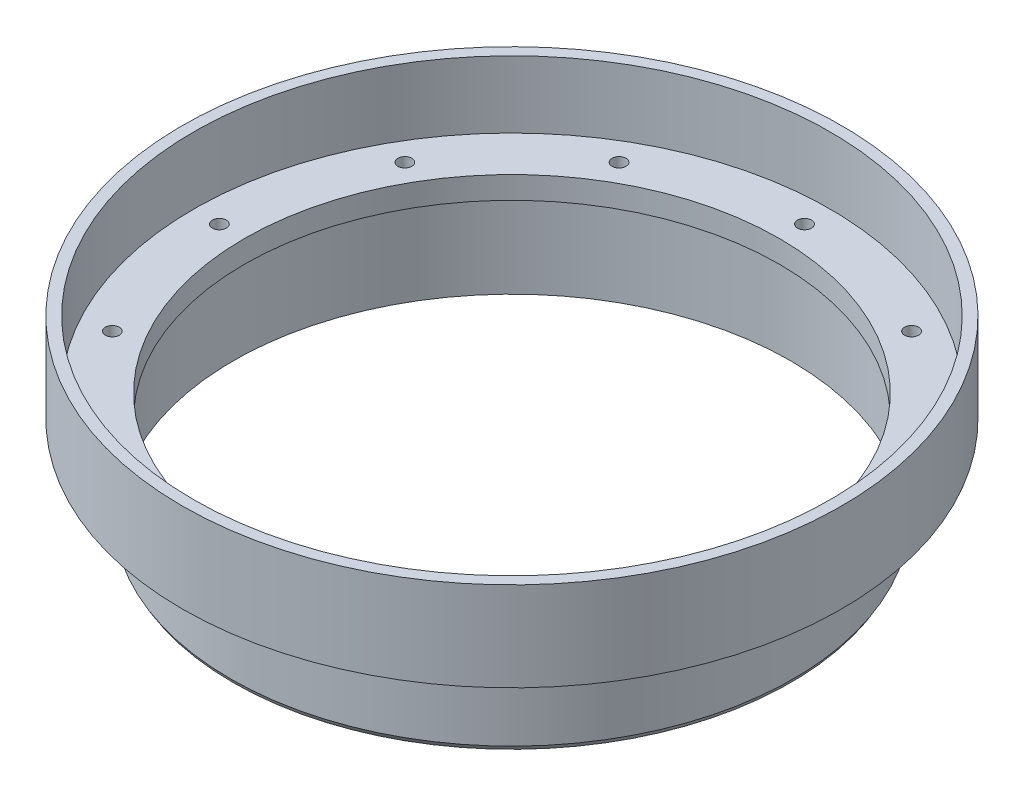
ISO-10303-21;
HEADER;
FILE_DESCRIPTION(('STEP AP214'),'2;1');
FILE_NAME('part.step','',(''),(''),'','','');
FILE_SCHEMA(('AUTOMOTIVE_DESIGN { 1 0 10303 214 1 1 1 1 }'));
ENDSEC;
DATA;
#1=APPLICATION_CONTEXT('core data for automotive mechanical design processes');
#2=APPLICATION_PROTOCOL_DEFINITION('international standard','automotive_design',2000,#1);
#3=PRODUCT_CONTEXT('',#1,'mechanical');
#4=PRODUCT('Part','Part','',(#3));
#5=PRODUCT_RELATED_PRODUCT_CATEGORY('part','',(#4));
#6=PRODUCT_DEFINITION_FORMATION('','',#4);
#7=PRODUCT_DEFINITION_CONTEXT('part definition',#1,'design');
#8=PRODUCT_DEFINITION('design','',#6,#7);
#9=PRODUCT_DEFINITION_SHAPE('','',#8);
#10=(LENGTH_UNIT() NAMED_UNIT(*) SI_UNIT(.MILLI.,.METRE.));
#11=(NAMED_UNIT(*) PLANE_ANGLE_UNIT() SI_UNIT($,.RADIAN.));
#12=(NAMED_UNIT(*) SI_UNIT($,.STERADIAN.) SOLID_ANGLE_UNIT());
#13=UNCERTAINTY_MEASURE_WITH_UNIT(LENGTH_MEASURE(1.E-05),#10,'distance_accuracy_value','');
#14=(GEOMETRIC_REPRESENTATION_CONTEXT(3) GLOBAL_UNCERTAINTY_ASSIGNED_CONTEXT((#13)) GLOBAL_UNIT_ASSIGNED_CONTEXT((#10,
#11,#12)) REPRESENTATION_CONTEXT('',''));
#15=CARTESIAN_POINT('',(0.,0.,0.));
#16=DIRECTION('',(0.,0.,1.));
#17=DIRECTION('',(1.,0.,0.));
#18=AXIS2_PLACEMENT_3D('',#15,#16,#17);
#19=CARTESIAN_POINT('',(-45.339,0.,0.));
#20=DIRECTION('',(0.,1.,0.));
#21=DIRECTION('',(0.,0.,1.));
#22=AXIS2_PLACEMENT_3D('',#19,#20,#21);
#23=PLANE('',#22);
#24=CARTESIAN_POINT('',(-36.0751542200448,0.,20.8279999999996));
#25=DIRECTION('',(0.,1.,0.));
#26=DIRECTION('',(0.,0.,1.));
#27=AXIS2_PLACEMENT_3D('',#24,#25,#26);
#28=CIRCLE('',#27,0.996949999999996);
#29=CARTESIAN_POINT('',(-36.0751542200448,0.,21.8249499999996));
#30=VERTEX_POINT('',#29);
#31=EDGE_CURVE('E154',#30,#30,#28,.T.);
#32=ORIENTED_EDGE('',*,*,#31,.F.);
#33=EDGE_LOOP('',(#32));
#34=FACE_BOUND('',#33,.T.);
#35=CARTESIAN_POINT('',(-20.8280000000004,0.,36.0751542200444));
#36=DIRECTION('',(0.,1.,0.));
#37=DIRECTION('',(0.,0.,1.));
#38=AXIS2_PLACEMENT_3D('',#35,#36,#37);
#39=CIRCLE('',#38,0.99695);
#40=CARTESIAN_POINT('',(-20.8280000000004,0.,37.0721042200444));
#41=VERTEX_POINT('',#40);
#42=EDGE_CURVE('E158',#41,#41,#39,.T.);
#43=ORIENTED_EDGE('',*,*,#42,.F.);
#44=EDGE_LOOP('',(#43));
#45=FACE_BOUND('',#44,.T.);
#46=CARTESIAN_POINT('',(-3.57226130743964E-13,0.,41.656));
#47=DIRECTION('',(0.,1.,0.));
#48=DIRECTION('',(0.,0.,1.));
#49=AXIS2_PLACEMENT_3D('',#46,#47,#48);
#50=CIRCLE('',#49,0.996949999999999);
#51=CARTESIAN_POINT('',(-3.57226130743964E-13,0.,42.65295));
#52=VERTEX_POINT('',#51);
#53=EDGE_CURVE('E86',#52,#52,#50,.T.);
#54=ORIENTED_EDGE('',*,*,#53,.F.);
#55=EDGE_LOOP('',(#54));
#56=FACE_BOUND('',#55,.T.);
#57=CARTESIAN_POINT('',(20.8279999999997,0.,36.0751542200447));
#58=DIRECTION('',(0.,1.,0.));
#59=DIRECTION('',(0.,0.,1.));
#60=AXIS2_PLACEMENT_3D('',#57,#58,#59);
#61=CIRCLE('',#60,0.99695);
#62=CARTESIAN_POINT('',(20.8279999999997,0.,37.0721042200447));
#63=VERTEX_POINT('',#62);
#64=EDGE_CURVE('E75',#63,#63,#61,.T.);
#65=ORIENTED_EDGE('',*,*,#64,.F.);
#66=EDGE_LOOP('',(#65));
#67=FACE_BOUND('',#66,.T.);
#68=CARTESIAN_POINT('',(36.0751542200444,0.,20.8280000000002));
#69=DIRECTION('',(0.,1.,0.));
#70=DIRECTION('',(0.,0.,1.));
#71=AXIS2_PLACEMENT_3D('',#68,#69,#70);
#72=CIRCLE('',#71,0.996949999999996);
#73=CARTESIAN_POINT('',(36.0751542200444,0.,21.8249500000002));
#74=VERTEX_POINT('',#73);
#75=EDGE_CURVE('E72',#74,#74,#72,.T.);
#76=ORIENTED_EDGE('',*,*,#75,.F.);
#77=EDGE_LOOP('',(#76));
#78=FACE_BOUND('',#77,.T.);
#79=CARTESIAN_POINT('',(41.656,0.,2.30283964218628E-13));
#80=DIRECTION('',(0.,1.,0.));
#81=DIRECTION('',(0.,0.,1.));
#82=AXIS2_PLACEMENT_3D('',#79,#80,#81);
#83=CIRCLE('',#82,0.996949999999996);
#84=CARTESIAN_POINT('',(41.656,0.,0.996950000000227));
#85=VERTEX_POINT('',#84);
#86=EDGE_CURVE('E71',#85,#85,#83,.T.);
#87=ORIENTED_EDGE('',*,*,#86,.F.);
#88=EDGE_LOOP('',(#87));
#89=FACE_BOUND('',#88,.T.);
#90=CARTESIAN_POINT('',(36.0751542200447,0.,-20.8279999999998));
#91=DIRECTION('',(0.,1.,0.));
#92=DIRECTION('',(0.,0.,1.));
#93=AXIS2_PLACEMENT_3D('',#90,#91,#92);
#94=CIRCLE('',#93,0.996949999999996);
#95=CARTESIAN_POINT('',(36.0751542200447,0.,-19.8310499999998));
#96=VERTEX_POINT('',#95);
#97=EDGE_CURVE('E68',#96,#96,#94,.T.);
#98=ORIENTED_EDGE('',*,*,#97,.F.);
#99=EDGE_LOOP('',(#98));
#100=FACE_BOUND('',#99,.T.);
#101=CARTESIAN_POINT('',(20.8280000000001,0.,-36.0751542200445));
#102=DIRECTION('',(0.,1.,0.));
#103=DIRECTION('',(0.,0.,1.));
#104=AXIS2_PLACEMENT_3D('',#101,#102,#103);
#105=CIRCLE('',#104,0.99695);
#106=CARTESIAN_POINT('',(20.8280000000001,0.,-35.0782042200445));
#107=VERTEX_POINT('',#106);
#108=EDGE_CURVE('E64',#107,#107,#105,.T.);
#109=ORIENTED_EDGE('',*,*,#108,.F.);
#110=EDGE_LOOP('',(#109));
#111=FACE_BOUND('',#110,.T.);
#112=CARTESIAN_POINT('',(1.1259128775605E-13,0.,-41.656));
#113=DIRECTION('',(0.,1.,0.));
#114=DIRECTION('',(0.,0.,1.));
#115=AXIS2_PLACEMENT_3D('',#112,#113,#114);
#116=CIRCLE('',#115,0.996949999999999);
#117=CARTESIAN_POINT('',(1.1259128775605E-13,0.,-40.65905));
#118=VERTEX_POINT('',#117);
#119=EDGE_CURVE('E60',#118,#118,#116,.T.);
#120=ORIENTED_EDGE('',*,*,#119,.F.);
#121=EDGE_LOOP('',(#120));
#122=FACE_BOUND('',#121,.T.);
#123=CARTESIAN_POINT('',(-20.8279999999999,0.,-36.0751542200446));
#124=DIRECTION('',(0.,1.,0.));
#125=DIRECTION('',(0.,0.,1.));
#126=AXIS2_PLACEMENT_3D('',#123,#124,#125);
#127=CIRCLE('',#126,0.99695);
#128=CARTESIAN_POINT('',(-20.8279999999999,0.,-35.0782042200446));
#129=VERTEX_POINT('',#128);
#130=EDGE_CURVE('E56',#129,#129,#127,.T.);
#131=ORIENTED_EDGE('',*,*,#130,.F.);
#132=EDGE_LOOP('',(#131));
#133=FACE_BOUND('',#132,.T.);
#134=CARTESIAN_POINT('',(-36.0751542200446,0.,-20.828));
#135=DIRECTION('',(0.,1.,0.));
#136=DIRECTION('',(0.,0.,1.));
#137=AXIS2_PLACEMENT_3D('',#134,#135,#136);
#138=CIRCLE('',#137,0.996949999999996);
#139=CARTESIAN_POINT('',(-36.0751542200446,0.,-19.83105));
#140=VERTEX_POINT('',#139);
#141=EDGE_CURVE('E52',#140,#140,#138,.T.);
#142=ORIENTED_EDGE('',*,*,#141,.F.);
#143=EDGE_LOOP('',(#142));
#144=FACE_BOUND('',#143,.T.);
#145=CARTESIAN_POINT('',(-41.656,0.,0.));
#146=DIRECTION('',(0.,1.,0.));
#147=DIRECTION('',(0.,0.,1.));
#148=AXIS2_PLACEMENT_3D('',#145,#146,#147);
#149=CIRCLE('',#148,0.996949999999996);
#150=CARTESIAN_POINT('',(-41.656,0.,0.996950000000002));
#151=VERTEX_POINT('',#150);
#152=EDGE_CURVE('E51',#151,#151,#149,.T.);
#153=ORIENTED_EDGE('',*,*,#152,.F.);
#154=EDGE_LOOP('',(#153));
#155=FACE_BOUND('',#154,.T.);
#156=CARTESIAN_POINT('',(0.,0.,0.));
#157=DIRECTION('',(0.,1.,0.));
#158=DIRECTION('',(0.,0.,1.));
#159=AXIS2_PLACEMENT_3D('',#156,#157,#158);
#160=CIRCLE('',#159,45.339);
#161=CARTESIAN_POINT('',(0.,0.,45.339));
#162=VERTEX_POINT('',#161);
#163=EDGE_CURVE('E110',#162,#162,#160,.T.);
#164=ORIENTED_EDGE('',*,*,#163,.T.);
#165=EDGE_LOOP('',(#164));
#166=FACE_BOUND('',#165,.T.);
#167=CARTESIAN_POINT('',(0.,0.,0.));
#168=DIRECTION('',(0.,1.,0.));
#169=DIRECTION('',(0.,0.,1.));
#170=AXIS2_PLACEMENT_3D('',#167,#168,#169);
#171=CIRCLE('',#170,38.1);
#172=CARTESIAN_POINT('',(0.,0.,38.1));
#173=VERTEX_POINT('',#172);
#174=EDGE_CURVE('E10',#173,#173,#171,.T.);
#175=ORIENTED_EDGE('',*,*,#174,.F.);
#176=EDGE_LOOP('',(#175));
#177=FACE_BOUND('',#176,.T.);
#178=ADVANCED_FACE('F32',(#34,#45,#56,#67,#78,#89,#100,#111,#122,#133,#144,#155,#166,#177),#23,.T.);
#179=CARTESIAN_POINT('',(0.,55.,0.));
#180=DIRECTION('',(0.,1.,0.));
#181=DIRECTION('',(0.,0.,1.));
#182=AXIS2_PLACEMENT_3D('',#179,#180,#181);
#183=CYLINDRICAL_SURFACE('',#182,38.1);
#184=ORIENTED_EDGE('',*,*,#174,.T.);
#185=EDGE_LOOP('',(#184));
#186=FACE_BOUND('',#185,.T.);
#187=CARTESIAN_POINT('',(0.,-3.175,0.));
#188=DIRECTION('',(0.,1.,0.));
#189=DIRECTION('',(0.,0.,1.));
#190=AXIS2_PLACEMENT_3D('',#187,#188,#189);
#191=CIRCLE('',#190,38.1);
#192=CARTESIAN_POINT('',(0.,-3.175,38.1));
#193=VERTEX_POINT('',#192);
#194=EDGE_CURVE('E39',#193,#193,#191,.T.);
#195=ORIENTED_EDGE('',*,*,#194,.F.);
#196=EDGE_LOOP('',(#195));
#197=FACE_BOUND('',#196,.T.);
#198=ADVANCED_FACE('F138',(#186,#197),#183,.F.);
#199=CARTESIAN_POINT('',(-38.1,-3.175,0.));
#200=DIRECTION('',(0.,-1.,0.));
#201=DIRECTION('',(0.,0.,-1.));
#202=AXIS2_PLACEMENT_3D('',#199,#200,#201);
#203=PLANE('',#202);
#204=ORIENTED_EDGE('',*,*,#194,.T.);
#205=EDGE_LOOP('',(#204));
#206=FACE_BOUND('',#205,.T.);
#207=CARTESIAN_POINT('',(0.,-3.175,0.));
#208=DIRECTION('',(0.,1.,0.));
#209=DIRECTION('',(0.,0.,1.));
#210=AXIS2_PLACEMENT_3D('',#207,#208,#209);
#211=CIRCLE('',#210,39.6875);
#212=CARTESIAN_POINT('',(0.,-3.175,39.6875));
#213=VERTEX_POINT('',#212);
#214=EDGE_CURVE('E44',#213,#213,#211,.T.);
#215=ORIENTED_EDGE('',*,*,#214,.F.);
#216=EDGE_LOOP('',(#215));
#217=FACE_BOUND('',#216,.T.);
#218=ADVANCED_FACE('F136',(#206,#217),#203,.T.);
#219=CARTESIAN_POINT('',(0.,55.,0.));
#220=DIRECTION('',(0.,1.,0.));
#221=DIRECTION('',(0.,0.,1.));
#222=AXIS2_PLACEMENT_3D('',#219,#220,#221);
#223=CYLINDRICAL_SURFACE('',#222,39.6875);
#224=ORIENTED_EDGE('',*,*,#214,.T.);
#225=EDGE_LOOP('',(#224));
#226=FACE_BOUND('',#225,.T.);
#227=CARTESIAN_POINT('',(0.,-15.875,0.));
#228=DIRECTION('',(0.,1.,0.));
#229=DIRECTION('',(0.,0.,1.));
#230=AXIS2_PLACEMENT_3D('',#227,#228,#229);
#231=CIRCLE('',#230,39.6875);
#232=CARTESIAN_POINT('',(0.,-15.875,39.6875));
#233=VERTEX_POINT('',#232);
#234=EDGE_CURVE('E128',#233,#233,#231,.T.);
#235=ORIENTED_EDGE('',*,*,#234,.F.);
#236=EDGE_LOOP('',(#235));
#237=FACE_BOUND('',#236,.T.);
#238=ADVANCED_FACE('F133',(#226,#237),#223,.F.);
#239=CARTESIAN_POINT('',(0.,-15.2150886423163,0.));
#240=DIRECTION('',(0.,1.,0.));
#241=DIRECTION('',(0.,0.,1.));
#242=AXIS2_PLACEMENT_3D('',#239,#240,#241);
#243=CONICAL_SURFACE('',#242,40.0685,0.523598775598298);
#244=ORIENTED_EDGE('',*,*,#234,.T.);
#245=EDGE_LOOP('',(#244));
#246=FACE_BOUND('',#245,.T.);
#247=CARTESIAN_POINT('',(0.,-15.2150886423163,0.));
#248=DIRECTION('',(0.,1.,0.));
#249=DIRECTION('',(0.,0.,1.));
#250=AXIS2_PLACEMENT_3D('',#247,#248,#249);
#251=CIRCLE('',#250,40.0685);
#252=CARTESIAN_POINT('',(0.,-15.2150886423163,40.0685));
#253=VERTEX_POINT('',#252);
#254=EDGE_CURVE('E125',#253,#253,#251,.T.);
#255=ORIENTED_EDGE('',*,*,#254,.F.);
#256=EDGE_LOOP('',(#255));
#257=FACE_BOUND('',#256,.T.);
#258=ADVANCED_FACE('F145',(#246,#257),#243,.T.);
#259=CARTESIAN_POINT('',(0.,55.,0.));
#260=DIRECTION('',(0.,1.,0.));
#261=DIRECTION('',(0.,0.,1.));
#262=AXIS2_PLACEMENT_3D('',#259,#260,#261);
#263=CYLINDRICAL_SURFACE('',#262,40.0685);
#264=ORIENTED_EDGE('',*,*,#254,.T.);
#265=EDGE_LOOP('',(#264));
#266=FACE_BOUND('',#265,.T.);
#267=CARTESIAN_POINT('',(0.,-3.175,0.));
#268=DIRECTION('',(0.,1.,0.));
#269=DIRECTION('',(0.,0.,1.));
#270=AXIS2_PLACEMENT_3D('',#267,#268,#269);
#271=CIRCLE('',#270,40.0685);
#272=CARTESIAN_POINT('',(0.,-3.175,40.0685));
#273=VERTEX_POINT('',#272);
#274=EDGE_CURVE('E122',#273,#273,#271,.T.);
#275=ORIENTED_EDGE('',*,*,#274,.F.);
#276=EDGE_LOOP('',(#275));
#277=FACE_BOUND('',#276,.T.);
#278=ADVANCED_FACE('F206',(#266,#277),#263,.T.);
#279=CARTESIAN_POINT('',(-40.0685,-3.175,0.));
#280=DIRECTION('',(0.,-1.,0.));
#281=DIRECTION('',(0.,0.,-1.));
#282=AXIS2_PLACEMENT_3D('',#279,#280,#281);
#283=PLANE('',#282);
#284=CARTESIAN_POINT('',(-36.0751542200448,-3.175,20.8279999999996));
#285=DIRECTION('',(0.,-1.,0.));
#286=DIRECTION('',(0.,0.,-1.));
#287=AXIS2_PLACEMENT_3D('',#284,#285,#286);
#288=CIRCLE('',#287,0.996949999999996);
#289=CARTESIAN_POINT('',(-36.0751542200448,-3.175,19.8310499999996));
#290=VERTEX_POINT('',#289);
#291=EDGE_CURVE('E442',#290,#290,#288,.T.);
#292=ORIENTED_EDGE('',*,*,#291,.F.);
#293=EDGE_LOOP('',(#292));
#294=FACE_BOUND('',#293,.T.);
#295=CARTESIAN_POINT('',(-20.8280000000004,-3.175,36.0751542200444));
#296=DIRECTION('',(0.,-1.,0.));
#297=DIRECTION('',(0.,0.,-1.));
#298=AXIS2_PLACEMENT_3D('',#295,#296,#297);
#299=CIRCLE('',#298,0.99695);
#300=CARTESIAN_POINT('',(-20.8280000000004,-3.175,35.0782042200444));
#301=VERTEX_POINT('',#300);
#302=EDGE_CURVE('E35',#301,#301,#299,.T.);
#303=ORIENTED_EDGE('',*,*,#302,.F.);
#304=EDGE_LOOP('',(#303));
#305=FACE_BOUND('',#304,.T.);
#306=CARTESIAN_POINT('',(-3.57226130743964E-13,-3.175,41.656));
#307=DIRECTION('',(0.,-1.,0.));
#308=DIRECTION('',(0.,0.,-1.));
#309=AXIS2_PLACEMENT_3D('',#306,#307,#308);
#310=CIRCLE('',#309,0.996949999999999);
#311=CARTESIAN_POINT('',(-3.57226130743964E-13,-3.175,40.65905));
#312=VERTEX_POINT('',#311);
#313=EDGE_CURVE('E81',#312,#312,#310,.T.);
#314=ORIENTED_EDGE('',*,*,#313,.F.);
#315=EDGE_LOOP('',(#314));
#316=FACE_BOUND('',#315,.T.);
#317=CARTESIAN_POINT('',(20.8279999999997,-3.175,36.0751542200447));
#318=DIRECTION('',(0.,-1.,0.));
#319=DIRECTION('',(0.,0.,-1.));
#320=AXIS2_PLACEMENT_3D('',#317,#318,#319);
#321=CIRCLE('',#320,0.99695);
#322=CARTESIAN_POINT('',(20.8279999999997,-3.175,35.0782042200447));
#323=VERTEX_POINT('',#322);
#324=EDGE_CURVE('E73',#323,#323,#321,.T.);
#325=ORIENTED_EDGE('',*,*,#324,.F.);
#326=EDGE_LOOP('',(#325));
#327=FACE_BOUND('',#326,.T.);
#328=CARTESIAN_POINT('',(36.0751542200444,-3.175,20.8280000000002));
#329=DIRECTION('',(0.,-1.,0.));
#330=DIRECTION('',(0.,0.,-1.));
#331=AXIS2_PLACEMENT_3D('',#328,#329,#330);
#332=CIRCLE('',#331,0.996949999999996);
#333=CARTESIAN_POINT('',(36.0751542200444,-3.175,19.8310500000002));
#334=VERTEX_POINT('',#333);
#335=EDGE_CURVE('E69',#334,#334,#332,.T.);
#336=ORIENTED_EDGE('',*,*,#335,.F.);
#337=EDGE_LOOP('',(#336));
#338=FACE_BOUND('',#337,.T.);
#339=CARTESIAN_POINT('',(41.656,-3.175,2.30283964218628E-13));
#340=DIRECTION('',(0.,-1.,0.));
#341=DIRECTION('',(0.,0.,-1.));
#342=AXIS2_PLACEMENT_3D('',#339,#340,#341);
#343=CIRCLE('',#342,0.996949999999996);
#344=CARTESIAN_POINT('',(41.656,-3.175,-0.996949999999766));
#345=VERTEX_POINT('',#344);
#346=EDGE_CURVE('E92',#345,#345,#343,.T.);
#347=ORIENTED_EDGE('',*,*,#346,.F.);
#348=EDGE_LOOP('',(#347));
#349=FACE_BOUND('',#348,.T.);
#350=CARTESIAN_POINT('',(36.0751542200447,-3.175,-20.8279999999998));
#351=DIRECTION('',(0.,-1.,0.));
#352=DIRECTION('',(0.,0.,-1.));
#353=AXIS2_PLACEMENT_3D('',#350,#351,#352);
#354=CIRCLE('',#353,0.996949999999996);
#355=CARTESIAN_POINT('',(36.0751542200447,-3.175,-21.8249499999998));
#356=VERTEX_POINT('',#355);
#357=EDGE_CURVE('E65',#356,#356,#354,.T.);
#358=ORIENTED_EDGE('',*,*,#357,.F.);
#359=EDGE_LOOP('',(#358));
#360=FACE_BOUND('',#359,.T.);
#361=CARTESIAN_POINT('',(20.8280000000001,-3.175,-36.0751542200445));
#362=DIRECTION('',(0.,-1.,0.));
#363=DIRECTION('',(0.,0.,-1.));
#364=AXIS2_PLACEMENT_3D('',#361,#362,#363);
#365=CIRCLE('',#364,0.99695);
#366=CARTESIAN_POINT('',(20.8280000000001,-3.175,-37.0721042200445));
#367=VERTEX_POINT('',#366);
#368=EDGE_CURVE('E61',#367,#367,#365,.T.);
#369=ORIENTED_EDGE('',*,*,#368,.F.);
#370=EDGE_LOOP('',(#369));
#371=FACE_BOUND('',#370,.T.);
#372=CARTESIAN_POINT('',(1.1259128775605E-13,-3.175,-41.656));
#373=DIRECTION('',(0.,-1.,0.));
#374=DIRECTION('',(0.,0.,-1.));
#375=AXIS2_PLACEMENT_3D('',#372,#373,#374);
#376=CIRCLE('',#375,0.996949999999999);
#377=CARTESIAN_POINT('',(1.1259128775605E-13,-3.175,-42.65295));
#378=VERTEX_POINT('',#377);
#379=EDGE_CURVE('E57',#378,#378,#376,.T.);
#380=ORIENTED_EDGE('',*,*,#379,.F.);
#381=EDGE_LOOP('',(#380));
#382=FACE_BOUND('',#381,.T.);
#383=CARTESIAN_POINT('',(-20.8279999999999,-3.175,-36.0751542200446));
#384=DIRECTION('',(0.,-1.,0.));
#385=DIRECTION('',(0.,0.,-1.));
#386=AXIS2_PLACEMENT_3D('',#383,#384,#385);
#387=CIRCLE('',#386,0.99695);
#388=CARTESIAN_POINT('',(-20.8279999999999,-3.175,-37.0721042200446));
#389=VERTEX_POINT('',#388);
#390=EDGE_CURVE('E53',#389,#389,#387,.T.);
#391=ORIENTED_EDGE('',*,*,#390,.F.);
#392=EDGE_LOOP('',(#391));
#393=FACE_BOUND('',#392,.T.);
#394=CARTESIAN_POINT('',(-36.0751542200446,-3.175,-20.828));
#395=DIRECTION('',(0.,-1.,0.));
#396=DIRECTION('',(0.,0.,-1.));
#397=AXIS2_PLACEMENT_3D('',#394,#395,#396);
#398=CIRCLE('',#397,0.996949999999996);
#399=CARTESIAN_POINT('',(-36.0751542200446,-3.175,-21.82495));
#400=VERTEX_POINT('',#399);
#401=EDGE_CURVE('E48',#400,#400,#398,.T.);
#402=ORIENTED_EDGE('',*,*,#401,.F.);
#403=EDGE_LOOP('',(#402));
#404=FACE_BOUND('',#403,.T.);
#405=CARTESIAN_POINT('',(-41.656,-3.175,0.));
#406=DIRECTION('',(0.,-1.,0.));
#407=DIRECTION('',(0.,0.,-1.));
#408=AXIS2_PLACEMENT_3D('',#405,#406,#407);
#409=CIRCLE('',#408,0.996949999999996);
#410=CARTESIAN_POINT('',(-41.656,-3.175,-0.996949999999991));
#411=VERTEX_POINT('',#410);
#412=EDGE_CURVE('E107',#411,#411,#409,.T.);
#413=ORIENTED_EDGE('',*,*,#412,.F.);
#414=EDGE_LOOP('',(#413));
#415=FACE_BOUND('',#414,.T.);
#416=ORIENTED_EDGE('',*,*,#274,.T.);
#417=EDGE_LOOP('',(#416));
#418=FACE_BOUND('',#417,.T.);
#419=CARTESIAN_POINT('',(0.,-3.175,0.));
#420=DIRECTION('',(0.,1.,0.));
#421=DIRECTION('',(0.,0.,1.));
#422=AXIS2_PLACEMENT_3D('',#419,#420,#421);
#423=CIRCLE('',#422,46.9265);
#424=CARTESIAN_POINT('',(0.,-3.175,46.9265));
#425=VERTEX_POINT('',#424);
#426=EDGE_CURVE('E119',#425,#425,#423,.T.);
#427=ORIENTED_EDGE('',*,*,#426,.F.);
#428=EDGE_LOOP('',(#427));
#429=FACE_BOUND('',#428,.T.);
#430=ADVANCED_FACE('F202',(#294,#305,#316,#327,#338,#349,#360,#371,#382,#393,#404,#415,#418,
#429),#283,.T.);
#431=CARTESIAN_POINT('',(0.,55.,0.));
#432=DIRECTION('',(0.,1.,0.));
#433=DIRECTION('',(0.,0.,1.));
#434=AXIS2_PLACEMENT_3D('',#431,#432,#433);
#435=CYLINDRICAL_SURFACE('',#434,46.9265);
#436=ORIENTED_EDGE('',*,*,#426,.T.);
#437=EDGE_LOOP('',(#436));
#438=FACE_BOUND('',#437,.T.);
#439=CARTESIAN_POINT('',(0.,9.525,0.));
#440=DIRECTION('',(0.,1.,0.));
#441=DIRECTION('',(0.,0.,1.));
#442=AXIS2_PLACEMENT_3D('',#439,#440,#441);
#443=CIRCLE('',#442,46.9265);
#444=CARTESIAN_POINT('',(0.,9.525,46.9265));
#445=VERTEX_POINT('',#444);
#446=EDGE_CURVE('E116',#445,#445,#443,.T.);
#447=ORIENTED_EDGE('',*,*,#446,.F.);
#448=EDGE_LOOP('',(#447));
#449=FACE_BOUND('',#448,.T.);
#450=ADVANCED_FACE('F195',(#438,#449),#435,.T.);
#451=CARTESIAN_POINT('',(-46.9265,9.525,0.));
#452=DIRECTION('',(0.,1.,0.));
#453=DIRECTION('',(0.,0.,1.));
#454=AXIS2_PLACEMENT_3D('',#451,#452,#453);
#455=PLANE('',#454);
#456=ORIENTED_EDGE('',*,*,#446,.T.);
#457=EDGE_LOOP('',(#456));
#458=FACE_BOUND('',#457,.T.);
#459=CARTESIAN_POINT('',(0.,9.525,0.));
#460=DIRECTION('',(0.,1.,0.));
#461=DIRECTION('',(0.,0.,1.));
#462=AXIS2_PLACEMENT_3D('',#459,#460,#461);
#463=CIRCLE('',#462,45.339);
#464=CARTESIAN_POINT('',(0.,9.525,45.339));
#465=VERTEX_POINT('',#464);
#466=EDGE_CURVE('E113',#465,#465,#463,.T.);
#467=ORIENTED_EDGE('',*,*,#466,.F.);
#468=EDGE_LOOP('',(#467));
#469=FACE_BOUND('',#468,.T.);
#470=ADVANCED_FACE('F185',(#458,#469),#455,.T.);
#471=CARTESIAN_POINT('',(0.,55.,0.));
#472=DIRECTION('',(0.,1.,0.));
#473=DIRECTION('',(0.,0.,1.));
#474=AXIS2_PLACEMENT_3D('',#471,#472,#473);
#475=CYLINDRICAL_SURFACE('',#474,45.339);
#476=ORIENTED_EDGE('',*,*,#466,.T.);
#477=EDGE_LOOP('',(#476));
#478=FACE_BOUND('',#477,.T.);
#479=ORIENTED_EDGE('',*,*,#163,.F.);
#480=EDGE_LOOP('',(#479));
#481=FACE_BOUND('',#480,.T.);
#482=ADVANCED_FACE('F182',(#478,#481),#475,.F.);
#483=CARTESIAN_POINT('',(-41.656,0.,0.));
#484=DIRECTION('',(0.,1.,0.));
#485=DIRECTION('',(0.,0.,1.));
#486=AXIS2_PLACEMENT_3D('',#483,#484,#485);
#487=CYLINDRICAL_SURFACE('',#486,0.996949999999996);
#488=ORIENTED_EDGE('',*,*,#412,.T.);
#489=EDGE_LOOP('',(#488));
#490=FACE_BOUND('',#489,.T.);
#491=ORIENTED_EDGE('',*,*,#152,.T.);
#492=EDGE_LOOP('',(#491));
#493=FACE_BOUND('',#492,.T.);
#494=ADVANCED_FACE('F184',(#490,#493),#487,.F.);
#495=CARTESIAN_POINT('',(-36.0751542200446,0.,-20.828));
#496=DIRECTION('',(0.,1.,0.));
#497=DIRECTION('',(0.,0.,1.));
#498=AXIS2_PLACEMENT_3D('',#495,#496,#497);
#499=CYLINDRICAL_SURFACE('',#498,0.996949999999996);
#500=ORIENTED_EDGE('',*,*,#401,.T.);
#501=EDGE_LOOP('',(#500));
#502=FACE_BOUND('',#501,.T.);
#503=ORIENTED_EDGE('',*,*,#141,.T.);
#504=EDGE_LOOP('',(#503));
#505=FACE_BOUND('',#504,.T.);
#506=ADVANCED_FACE('F192',(#502,#505),#499,.F.);
#507=CARTESIAN_POINT('',(-20.8279999999999,0.,-36.0751542200446));
#508=DIRECTION('',(0.,1.,0.));
#509=DIRECTION('',(0.,0.,1.));
#510=AXIS2_PLACEMENT_3D('',#507,#508,#509);
#511=CYLINDRICAL_SURFACE('',#510,0.99695);
#512=ORIENTED_EDGE('',*,*,#390,.T.);
#513=EDGE_LOOP('',(#512));
#514=FACE_BOUND('',#513,.T.);
#515=ORIENTED_EDGE('',*,*,#130,.T.);
#516=EDGE_LOOP('',(#515));
#517=FACE_BOUND('',#516,.T.);
#518=ADVANCED_FACE('F354',(#514,#517),#511,.F.);
#519=CARTESIAN_POINT('',(1.1259128775605E-13,0.,-41.656));
#520=DIRECTION('',(0.,1.,0.));
#521=DIRECTION('',(0.,0.,1.));
#522=AXIS2_PLACEMENT_3D('',#519,#520,#521);
#523=CYLINDRICAL_SURFACE('',#522,0.996949999999999);
#524=ORIENTED_EDGE('',*,*,#379,.T.);
#525=EDGE_LOOP('',(#524));
#526=FACE_BOUND('',#525,.T.);
#527=ORIENTED_EDGE('',*,*,#119,.T.);
#528=EDGE_LOOP('',(#527));
#529=FACE_BOUND('',#528,.T.);
#530=ADVANCED_FACE('F329',(#526,#529),#523,.F.);
#531=CARTESIAN_POINT('',(20.8280000000001,0.,-36.0751542200445));
#532=DIRECTION('',(0.,1.,0.));
#533=DIRECTION('',(0.,0.,1.));
#534=AXIS2_PLACEMENT_3D('',#531,#532,#533);
#535=CYLINDRICAL_SURFACE('',#534,0.99695);
#536=ORIENTED_EDGE('',*,*,#368,.T.);
#537=EDGE_LOOP('',(#536));
#538=FACE_BOUND('',#537,.T.);
#539=ORIENTED_EDGE('',*,*,#108,.T.);
#540=EDGE_LOOP('',(#539));
#541=FACE_BOUND('',#540,.T.);
#542=ADVANCED_FACE('F323',(#538,#541),#535,.F.);
#543=CARTESIAN_POINT('',(36.0751542200447,0.,-20.8279999999998));
#544=DIRECTION('',(0.,1.,0.));
#545=DIRECTION('',(0.,0.,1.));
#546=AXIS2_PLACEMENT_3D('',#543,#544,#545);
#547=CYLINDRICAL_SURFACE('',#546,0.996949999999996);
#548=ORIENTED_EDGE('',*,*,#357,.T.);
#549=EDGE_LOOP('',(#548));
#550=FACE_BOUND('',#549,.T.);
#551=ORIENTED_EDGE('',*,*,#97,.T.);
#552=EDGE_LOOP('',(#551));
#553=FACE_BOUND('',#552,.T.);
#554=ADVANCED_FACE('F328',(#550,#553),#547,.F.);
#555=CARTESIAN_POINT('',(41.656,0.,2.30283964218628E-13));
#556=DIRECTION('',(0.,1.,0.));
#557=DIRECTION('',(0.,0.,1.));
#558=AXIS2_PLACEMENT_3D('',#555,#556,#557);
#559=CYLINDRICAL_SURFACE('',#558,0.996949999999996);
#560=ORIENTED_EDGE('',*,*,#346,.T.);
#561=EDGE_LOOP('',(#560));
#562=FACE_BOUND('',#561,.T.);
#563=ORIENTED_EDGE('',*,*,#86,.T.);
#564=EDGE_LOOP('',(#563));
#565=FACE_BOUND('',#564,.T.);
#566=ADVANCED_FACE('F313',(#562,#565),#559,.F.);
#567=CARTESIAN_POINT('',(36.0751542200444,0.,20.8280000000002));
#568=DIRECTION('',(0.,1.,0.));
#569=DIRECTION('',(0.,0.,1.));
#570=AXIS2_PLACEMENT_3D('',#567,#568,#569);
#571=CYLINDRICAL_SURFACE('',#570,0.996949999999996);
#572=ORIENTED_EDGE('',*,*,#335,.T.);
#573=EDGE_LOOP('',(#572));
#574=FACE_BOUND('',#573,.T.);
#575=ORIENTED_EDGE('',*,*,#75,.T.);
#576=EDGE_LOOP('',(#575));
#577=FACE_BOUND('',#576,.T.);
#578=ADVANCED_FACE('F307',(#574,#577),#571,.F.);
#579=CARTESIAN_POINT('',(20.8279999999997,0.,36.0751542200447));
#580=DIRECTION('',(0.,1.,0.));
#581=DIRECTION('',(0.,0.,1.));
#582=AXIS2_PLACEMENT_3D('',#579,#580,#581);
#583=CYLINDRICAL_SURFACE('',#582,0.99695);
#584=ORIENTED_EDGE('',*,*,#324,.T.);
#585=EDGE_LOOP('',(#584));
#586=FACE_BOUND('',#585,.T.);
#587=ORIENTED_EDGE('',*,*,#64,.T.);
#588=EDGE_LOOP('',(#587));
#589=FACE_BOUND('',#588,.T.);
#590=ADVANCED_FACE('F312',(#586,#589),#583,.F.);
#591=CARTESIAN_POINT('',(-3.57226130743964E-13,0.,41.656));
#592=DIRECTION('',(0.,1.,0.));
#593=DIRECTION('',(0.,0.,1.));
#594=AXIS2_PLACEMENT_3D('',#591,#592,#593);
#595=CYLINDRICAL_SURFACE('',#594,0.996949999999999);
#596=ORIENTED_EDGE('',*,*,#313,.T.);
#597=EDGE_LOOP('',(#596));
#598=FACE_BOUND('',#597,.T.);
#599=ORIENTED_EDGE('',*,*,#53,.T.);
#600=EDGE_LOOP('',(#599));
#601=FACE_BOUND('',#600,.T.);
#602=ADVANCED_FACE('F297',(#598,#601),#595,.F.);
#603=CARTESIAN_POINT('',(-20.8280000000004,0.,36.0751542200444));
#604=DIRECTION('',(0.,1.,0.));
#605=DIRECTION('',(0.,0.,1.));
#606=AXIS2_PLACEMENT_3D('',#603,#604,#605);
#607=CYLINDRICAL_SURFACE('',#606,0.99695);
#608=ORIENTED_EDGE('',*,*,#302,.T.);
#609=EDGE_LOOP('',(#608));
#610=FACE_BOUND('',#609,.T.);
#611=ORIENTED_EDGE('',*,*,#42,.T.);
#612=EDGE_LOOP('',(#611));
#613=FACE_BOUND('',#612,.T.);
#614=ADVANCED_FACE('F291',(#610,#613),#607,.F.);
#615=CARTESIAN_POINT('',(-36.0751542200448,0.,20.8279999999996));
#616=DIRECTION('',(0.,1.,0.));
#617=DIRECTION('',(0.,0.,1.));
#618=AXIS2_PLACEMENT_3D('',#615,#616,#617);
#619=CYLINDRICAL_SURFACE('',#618,0.996949999999996);
#620=ORIENTED_EDGE('',*,*,#291,.T.);
#621=EDGE_LOOP('',(#620));
#622=FACE_BOUND('',#621,.T.);
#623=ORIENTED_EDGE('',*,*,#31,.T.);
#624=EDGE_LOOP('',(#623));
#625=FACE_BOUND('',#624,.T.);
#626=ADVANCED_FACE('F296',(#622,#625),#619,.F.);
#627=CLOSED_SHELL('',(#178,#198,#218,#238,#258,#278,#430,#450,#470,#482,#494,#506,#518,#530,
#542,#554,#566,#578,#590,#602,#614,#626));
#628=MANIFOLD_SOLID_BREP('B2',#627);
#629=ADVANCED_BREP_SHAPE_REPRESENTATION('',(#18,#628),#14);
#630=SHAPE_DEFINITION_REPRESENTATION(#9,#629);
ENDSEC;
END-ISO-10303-21;
